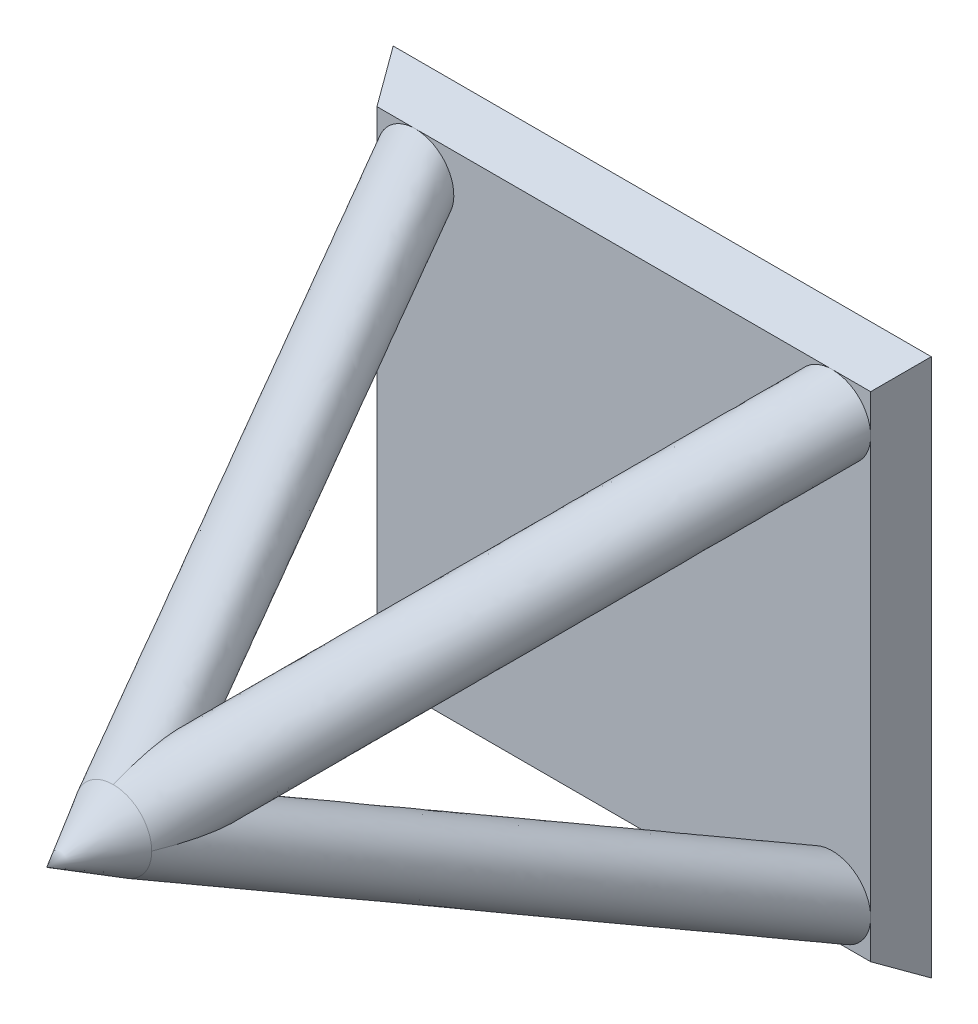
ISO-10303-21;
HEADER;
FILE_DESCRIPTION(('STEP AP214'),'2;1');
FILE_NAME('part.step','',(''),(''),'','','');
FILE_SCHEMA(('AUTOMOTIVE_DESIGN { 1 0 10303 214 1 1 1 1 }'));
ENDSEC;
DATA;
#1=APPLICATION_CONTEXT('core data for automotive mechanical design processes');
#2=APPLICATION_PROTOCOL_DEFINITION('international standard','automotive_design',2000,#1);
#3=PRODUCT_CONTEXT('',#1,'mechanical');
#4=PRODUCT('Part','Part','',(#3));
#5=PRODUCT_RELATED_PRODUCT_CATEGORY('part','',(#4));
#6=PRODUCT_DEFINITION_FORMATION('','',#4);
#7=PRODUCT_DEFINITION_CONTEXT('part definition',#1,'design');
#8=PRODUCT_DEFINITION('design','',#6,#7);
#9=PRODUCT_DEFINITION_SHAPE('','',#8);
#10=(LENGTH_UNIT() NAMED_UNIT(*) SI_UNIT(.MILLI.,.METRE.));
#11=(NAMED_UNIT(*) PLANE_ANGLE_UNIT() SI_UNIT($,.RADIAN.));
#12=(NAMED_UNIT(*) SI_UNIT($,.STERADIAN.) SOLID_ANGLE_UNIT());
#13=UNCERTAINTY_MEASURE_WITH_UNIT(LENGTH_MEASURE(1.E-05),#10,'distance_accuracy_value','');
#14=(GEOMETRIC_REPRESENTATION_CONTEXT(3) GLOBAL_UNCERTAINTY_ASSIGNED_CONTEXT((#13)) GLOBAL_UNIT_ASSIGNED_CONTEXT((#10,
#11,#12)) REPRESENTATION_CONTEXT('',''));
#15=CARTESIAN_POINT('',(0.,0.,0.));
#16=DIRECTION('',(0.,0.,1.));
#17=DIRECTION('',(1.,0.,0.));
#18=AXIS2_PLACEMENT_3D('',#15,#16,#17);
#19=CARTESIAN_POINT('',(0.,0.,1.));
#20=DIRECTION('',(0.,0.,1.));
#21=DIRECTION('',(1.,0.,0.));
#22=AXIS2_PLACEMENT_3D('',#19,#20,#21);
#23=PLANE('',#22);
#24=DIRECTION('',(-1.,0.,0.));
#25=VECTOR('',#24,1.);
#26=CARTESIAN_POINT('',(-7.,-6.42264973081037,1.));
#27=LINE('',#26,#25);
#28=CARTESIAN_POINT('',(-5.42264973081037,-6.42264973081037,1.));
#29=VERTEX_POINT('',#28);
#30=CARTESIAN_POINT('',(5.42264973081043,-6.42264973081037,1.));
#31=VERTEX_POINT('',#30);
#32=EDGE_CURVE('E254',#29,#31,#27,.F.);
#33=ORIENTED_EDGE('',*,*,#32,.T.);
#34=CARTESIAN_POINT('',(5.42264973081043,-5.42264973081032,1.));
#35=DIRECTION('',(0.,0.,1.));
#36=DIRECTION('',(0.,-1.,0.));
#37=AXIS2_PLACEMENT_3D('',#34,#35,#36);
#38=CIRCLE('',#37,1.);
#39=CARTESIAN_POINT('',(6.42264973081037,-5.42264973081032,1.));
#40=VERTEX_POINT('',#39);
#41=EDGE_CURVE('E52',#40,#31,#38,.T.);
#42=ORIENTED_EDGE('',*,*,#41,.F.);
#43=DIRECTION('',(0.,-1.,0.));
#44=VECTOR('',#43,1.);
#45=CARTESIAN_POINT('',(6.42264973081037,7.,1.));
#46=LINE('',#45,#44);
#47=CARTESIAN_POINT('',(6.42264973081037,5.42264973081037,1.));
#48=VERTEX_POINT('',#47);
#49=EDGE_CURVE('E259',#40,#48,#46,.F.);
#50=ORIENTED_EDGE('',*,*,#49,.T.);
#51=CARTESIAN_POINT('',(5.42264973081037,5.42264973081037,1.));
#52=DIRECTION('',(0.,0.,1.));
#53=DIRECTION('',(1.,0.,0.));
#54=AXIS2_PLACEMENT_3D('',#51,#52,#53);
#55=CIRCLE('',#54,1.);
#56=CARTESIAN_POINT('',(5.42264973081037,6.42264973081037,1.));
#57=VERTEX_POINT('',#56);
#58=EDGE_CURVE('E150',#57,#48,#55,.T.);
#59=ORIENTED_EDGE('',*,*,#58,.F.);
#60=DIRECTION('',(1.,0.,0.));
#61=VECTOR('',#60,1.);
#62=CARTESIAN_POINT('',(-7.,6.42264973081037,1.));
#63=LINE('',#62,#61);
#64=CARTESIAN_POINT('',(-5.42264973081039,6.42264973081037,1.));
#65=VERTEX_POINT('',#64);
#66=EDGE_CURVE('E260',#57,#65,#63,.F.);
#67=ORIENTED_EDGE('',*,*,#66,.T.);
#68=CARTESIAN_POINT('',(-5.42264973081039,5.42264973081035,1.));
#69=DIRECTION('',(0.,0.,1.));
#70=DIRECTION('',(0.,1.,0.));
#71=AXIS2_PLACEMENT_3D('',#68,#69,#70);
#72=CIRCLE('',#71,1.);
#73=CARTESIAN_POINT('',(-6.42264973081039,5.42264973081035,1.));
#74=VERTEX_POINT('',#73);
#75=EDGE_CURVE('E172',#74,#65,#72,.T.);
#76=ORIENTED_EDGE('',*,*,#75,.F.);
#77=DIRECTION('',(0.,1.,0.));
#78=VECTOR('',#77,1.);
#79=CARTESIAN_POINT('',(-6.42264973081037,7.,1.));
#80=LINE('',#79,#78);
#81=CARTESIAN_POINT('',(-6.42264973081037,-5.42264973081037,1.));
#82=VERTEX_POINT('',#81);
#83=EDGE_CURVE('E250',#74,#82,#80,.F.);
#84=ORIENTED_EDGE('',*,*,#83,.T.);
#85=CARTESIAN_POINT('',(-5.42264973081037,-5.42264973081037,1.));
#86=DIRECTION('',(0.,0.,1.));
#87=DIRECTION('',(-1.,0.,0.));
#88=AXIS2_PLACEMENT_3D('',#85,#86,#87);
#89=CIRCLE('',#88,1.);
#90=EDGE_CURVE('E59',#29,#82,#89,.T.);
#91=ORIENTED_EDGE('',*,*,#90,.F.);
#92=EDGE_LOOP('',(#33,#42,#50,#59,#67,#76,#84,#91));
#93=FACE_BOUND('',#92,.T.);
#94=ADVANCED_FACE('F33',(#93),#23,.T.);
#95=CARTESIAN_POINT('',(6.42264973081037,-6.42264973081037,1.));
#96=VERTEX_POINT('',#95);
#97=EDGE_CURVE('E255',#96,#40,#46,.F.);
#98=ORIENTED_EDGE('',*,*,#97,.T.);
#99=EDGE_CURVE('E179',#31,#40,#38,.T.);
#100=ORIENTED_EDGE('',*,*,#99,.F.);
#101=EDGE_CURVE('E249',#31,#96,#27,.F.);
#102=ORIENTED_EDGE('',*,*,#101,.T.);
#103=EDGE_LOOP('',(#98,#100,#102));
#104=FACE_BOUND('',#103,.T.);
#105=ADVANCED_FACE('F194',(#104),#23,.T.);
#106=CARTESIAN_POINT('',(0.,0.,14.2827248943264));
#107=DIRECTION('',(0.,0.,1.));
#108=DIRECTION('',(1.,0.,0.));
#109=AXIS2_PLACEMENT_3D('',#106,#107,#108);
#110=CIRCLE('',#109,1.);
#111=DIRECTION('',(0.353553390593266,0.353553390593266,-0.866025403784445));
#112=VECTOR('',#111,1.);
#113=SURFACE_OF_LINEAR_EXTRUSION('',#110,#112);
#114=EDGE_CURVE('E134',#48,#57,#55,.T.);
#115=ORIENTED_EDGE('',*,*,#114,.T.);
#116=ORIENTED_EDGE('',*,*,#58,.T.);
#117=EDGE_LOOP('',(#115,#116));
#118=FACE_BOUND('',#117,.T.);
#119=CARTESIAN_POINT('',(1.00000000000006,0.,14.2827248943262));
#120=CARTESIAN_POINT('',(1.00095247158773,0.,14.2803918097725));
#121=CARTESIAN_POINT('',(1.00190378573239,0.,14.2780582428588));
#122=CARTESIAN_POINT('',(1.04999941742813,-3.15060816440007E-12,14.159911554569));
#123=CARTESIAN_POINT('',(1.09428856773639,-3.88029549310956E-13,14.0429127130079));
#124=CARTESIAN_POINT('',(1.17649504622401,3.43390337549671E-13,13.8066698322435));
#125=CARTESIAN_POINT('',(1.21441185282404,-1.68816058794624E-12,13.6874256101422));
#126=CARTESIAN_POINT('',(1.26558620893331,-1.09452970989525E-12,13.5069173676038));
#127=CARTESIAN_POINT('',(1.28169773790506,-2.89122395048951E-13,13.4464578811851));
#128=CARTESIAN_POINT('',(1.31176474988059,3.00190177300115E-13,13.3250253952196));
#129=CARTESIAN_POINT('',(1.32572107611012,0.,13.2640526063995));
#130=CARTESIAN_POINT('',(1.35116004297669,0.,13.1415880318274));
#131=CARTESIAN_POINT('',(1.36264262043789,0.,13.0800962328623));
#132=CARTESIAN_POINT('',(1.38268857034576,0.,12.9565309102517));
#133=CARTESIAN_POINT('',(1.39124753220577,0.,12.8944566515766));
#134=CARTESIAN_POINT('',(1.40242129150147,0.,12.791194865343));
#135=CARTESIAN_POINT('',(1.40606787990283,0.,12.7501191725009));
#136=CARTESIAN_POINT('',(1.4114961727792,0.,12.6678472164657));
#137=CARTESIAN_POINT('',(1.41327825698485,0.,12.6266509795375));
#138=CARTESIAN_POINT('',(1.41458844448939,0.,12.544339253495));
#139=CARTESIAN_POINT('',(1.41412328319511,0.,12.5032238921256));
#140=CARTESIAN_POINT('',(1.41040552395881,0.,12.4210869293176));
#141=CARTESIAN_POINT('',(1.40715202075742,-1.04465119765171E-13,12.3800653626676));
#142=CARTESIAN_POINT('',(1.39794666536119,0.,12.3057766834646));
#143=CARTESIAN_POINT('',(1.39258385936221,0.,12.2724391260823));
#144=CARTESIAN_POINT('',(1.37877126368471,0.,12.2064304979355));
#145=CARTESIAN_POINT('',(1.37032603890566,0.,12.1737585166459));
#146=CARTESIAN_POINT('',(1.34926204043655,0.,12.1091744881437));
#147=CARTESIAN_POINT('',(1.33657992124411,0.,12.0772823806614));
#148=CARTESIAN_POINT('',(1.30576699966473,0.,12.0162463680328));
#149=CARTESIAN_POINT('',(1.28766439090466,0.,11.9870892437889));
#150=CARTESIAN_POINT('',(1.25433441731583,0.,11.945834876596));
#151=CARTESIAN_POINT('',(1.24138920273573,0.,11.9319043394484));
#152=CARTESIAN_POINT('',(1.21341853384276,0.,11.9063119275512));
#153=CARTESIAN_POINT('',(1.19839557822594,0.,11.8946473676539));
#154=CARTESIAN_POINT('',(1.16640868690299,0.,11.8741123585718));
#155=CARTESIAN_POINT('',(1.14943383321417,0.,11.8652587826481));
#156=CARTESIAN_POINT('',(1.11415155732731,0.,11.8507938938697));
#157=CARTESIAN_POINT('',(1.09584357911664,0.,11.8451839426713));
#158=CARTESIAN_POINT('',(1.05978775727,0.,11.8374268803725));
#159=CARTESIAN_POINT('',(1.04208212265294,0.,11.8350765001178));
#160=CARTESIAN_POINT('',(1.0065001489417,0.,11.8328755877828));
#161=CARTESIAN_POINT('',(0.988623542579538,0.,11.8330299819223));
#162=CARTESIAN_POINT('',(0.94017953149927,0.,11.836346501992));
#163=CARTESIAN_POINT('',(0.909759839811488,0.,11.8415979600568));
#164=CARTESIAN_POINT('',(0.850061560937177,0.,11.8565935212211));
#165=CARTESIAN_POINT('',(0.820786588103361,0.,11.8663507757101));
#166=CARTESIAN_POINT('',(0.764354622377072,0.,11.8887347699382));
#167=CARTESIAN_POINT('',(0.737160978345244,0.,11.901271285511));
#168=CARTESIAN_POINT('',(0.683978475773765,0.,11.9285586032647));
#169=CARTESIAN_POINT('',(0.657988004110974,0.,11.9433063212633));
#170=CARTESIAN_POINT('',(0.58145942147972,0.,11.9901498417349));
#171=CARTESIAN_POINT('',(0.532487379156112,0.,12.024791377357));
#172=CARTESIAN_POINT('',(0.429915774485225,0.,12.1045419348552));
#173=CARTESIAN_POINT('',(0.376940475904005,0.,12.1504297593496));
#174=CARTESIAN_POINT('',(0.274609364980922,0.,12.2460995276116));
#175=CARTESIAN_POINT('',(0.225256188127097,0.,12.2958842534236));
#176=CARTESIAN_POINT('',(0.129735733450403,0.,12.3980816477076));
#177=CARTESIAN_POINT('',(0.0835582338668074,0.,12.4504848470378));
#178=CARTESIAN_POINT('',(-0.00623025447493529,0.,12.5574511479309));
#179=CARTESIAN_POINT('',(-0.0498406569391731,0.,12.6120147381782));
#180=CARTESIAN_POINT('',(-0.177204799032464,0.,12.7781852260808));
#181=CARTESIAN_POINT('',(-0.257589167056134,0.,12.8923798964255));
#182=CARTESIAN_POINT('',(-0.410772800367922,0.,13.1256453919952));
#183=CARTESIAN_POINT('',(-0.483573814141634,-1.8566006021488E-13,13.2447150843324));
#184=CARTESIAN_POINT('',(-0.622280430420259,-5.1244225089425E-13,13.4867655718524));
#185=CARTESIAN_POINT('',(-0.688186685010203,-7.03935146997921E-13,13.6097459957332));
#186=CARTESIAN_POINT('',(-0.839750536160516,9.92717383731319E-13,13.911630843641));
#187=CARTESIAN_POINT('',(-0.922026837057796,3.79129073221929E-12,14.0922616779955));
#188=CARTESIAN_POINT('',(-0.998093865758277,0.,14.2780592080127));
#189=CARTESIAN_POINT('',(-0.999047512172989,0.,14.2803918227562));
#190=CARTESIAN_POINT('',(-1.,0.,14.2827248943264));
#191=B_SPLINE_CURVE_WITH_KNOTS('',3,(#119,#120,#121,#122,#123,#124,#125,#126,#127,#128,#129,
#130,#131,#132,#133,#134,#135,#136,#137,#138,#139,#140,#141,#142,#143,#144,#145,#146,#147,#148,
#149,#150,#151,#152,#153,#154,#155,#156,#157,#158,#159,#160,#161,#162,#163,#164,#165,#166,#167,
#168,#169,#170,#171,#172,#173,#174,#175,#176,#177,#178,#179,#180,#181,#182,#183,#184,#185,#186,
#187,#188,#189,#190),.UNSPECIFIED.,.F.,.F.,(4,2,2,2,2,2,2,2,2,2,2,2,2,2,2,2,2,2,2,2,2,2,2,2,2,2,
2,2,2,2,2,2,2,2,2,4),(0.,0.00756007770868939,0.382681877783375,0.757834366817101,
0.945511216454522,1.13311445023064,1.32072247454461,1.50861228839686,1.63229047661093,
1.75594347124023,1.87922608549966,2.00254873969712,2.10373931980384,2.20478064605285,
2.30740579928977,2.40950617558983,2.46635077405585,2.52312759607237,2.58023905205231,
2.6373744657412,2.69075658879766,2.74424371288378,2.83631460270398,2.92865594166437,
3.01835158168252,3.10792325856378,3.2874672894518,3.49746875143256,3.70762152785638,
3.91706271661904,4.12655155509135,4.54509366840899,4.9635390643266,5.38194484912462,
5.97667867126261,5.98423874896989),.UNSPECIFIED.);
#192=CARTESIAN_POINT('',(0.,0.,12.5506740867574));
#193=VERTEX_POINT('',#192);
#194=CARTESIAN_POINT('',(1.,0.,14.2827248943264));
#195=VERTEX_POINT('',#194);
#196=EDGE_CURVE('E146',#193,#195,#191,.F.);
#197=ORIENTED_EDGE('',*,*,#196,.F.);
#198=CARTESIAN_POINT('',(0.,0.999999999999999,14.2827248943264));
#199=CARTESIAN_POINT('',(0.,1.00095247158767,14.2803918097726));
#200=CARTESIAN_POINT('',(0.,1.00190378573233,14.2780582428589));
#201=CARTESIAN_POINT('',(1.92073782697346E-12,1.04999941742809,14.1599115545691));
#202=CARTESIAN_POINT('',(0.,1.09428856773634,14.042912713008));
#203=CARTESIAN_POINT('',(0.,1.17649504622396,13.8066698322436));
#204=CARTESIAN_POINT('',(1.75042928150668E-12,1.21441185282399,13.6874256101423));
#205=CARTESIAN_POINT('',(1.06882775437573E-12,1.26558620893327,13.5069173676039));
#206=CARTESIAN_POINT('',(2.85984764109471E-13,1.28169773790502,13.4464578811853));
#207=CARTESIAN_POINT('',(-2.87272866186111E-13,1.31176474988055,13.3250253952198));
#208=CARTESIAN_POINT('',(0.,1.32572107611008,13.2640526063996));
#209=CARTESIAN_POINT('',(0.,1.35116004297665,13.1415880318275));
#210=CARTESIAN_POINT('',(0.,1.36264262043786,13.0800962328624));
#211=CARTESIAN_POINT('',(0.,1.38268857034574,12.9565309102518));
#212=CARTESIAN_POINT('',(0.,1.39124753220574,12.8944566515767));
#213=CARTESIAN_POINT('',(0.,1.40242129150145,12.7911948653431));
#214=CARTESIAN_POINT('',(0.,1.40606787990281,12.750119172501));
#215=CARTESIAN_POINT('',(0.,1.41149617277919,12.6678472164658));
#216=CARTESIAN_POINT('',(0.,1.41327825698484,12.6266509795376));
#217=CARTESIAN_POINT('',(0.,1.41458844448938,12.5443392534951));
#218=CARTESIAN_POINT('',(0.,1.4141232831951,12.5032238921256));
#219=CARTESIAN_POINT('',(0.,1.4104055239588,12.4210869293176));
#220=CARTESIAN_POINT('',(1.0948436965104E-13,1.40715202075741,12.3800653626676));
#221=CARTESIAN_POINT('',(0.,1.39794666536118,12.3057766834646));
#222=CARTESIAN_POINT('',(0.,1.3925838593622,12.2724391260823));
#223=CARTESIAN_POINT('',(0.,1.37877126368471,12.2064304979355));
#224=CARTESIAN_POINT('',(0.,1.37032603890565,12.1737585166459));
#225=CARTESIAN_POINT('',(0.,1.34926204043655,12.1091744881437));
#226=CARTESIAN_POINT('',(0.,1.33657992124412,12.0772823806615));
#227=CARTESIAN_POINT('',(0.,1.30576699966476,12.0162463680329));
#228=CARTESIAN_POINT('',(0.,1.28766439090471,11.987089243789));
#229=CARTESIAN_POINT('',(0.,1.2543344173159,11.9458348765961));
#230=CARTESIAN_POINT('',(0.,1.2413892027358,11.9319043394485));
#231=CARTESIAN_POINT('',(0.,1.21341853384283,11.9063119275513));
#232=CARTESIAN_POINT('',(0.,1.19839557822602,11.894647367654));
#233=CARTESIAN_POINT('',(0.,1.16640868690307,11.8741123585719));
#234=CARTESIAN_POINT('',(0.,1.14943383321425,11.8652587826481));
#235=CARTESIAN_POINT('',(0.,1.11415155732739,11.8507938938697));
#236=CARTESIAN_POINT('',(0.,1.09584357911671,11.8451839426713));
#237=CARTESIAN_POINT('',(0.,1.05978775727008,11.8374268803726));
#238=CARTESIAN_POINT('',(0.,1.04208212265302,11.8350765001178));
#239=CARTESIAN_POINT('',(0.,1.00650014894178,11.8328755877828));
#240=CARTESIAN_POINT('',(0.,0.988623542579618,11.8330299819223));
#241=CARTESIAN_POINT('',(0.,0.94017953149936,11.836346501992));
#242=CARTESIAN_POINT('',(0.,0.909759839811587,11.8415979600568));
#243=CARTESIAN_POINT('',(0.,0.850061560937294,11.8565935212211));
#244=CARTESIAN_POINT('',(0.,0.820786588103487,11.86635077571));
#245=CARTESIAN_POINT('',(0.,0.764354622377217,11.8887347699382));
#246=CARTESIAN_POINT('',(0.,0.737160978345401,11.901271285511));
#247=CARTESIAN_POINT('',(0.,0.683978475773943,11.9285586032646));
#248=CARTESIAN_POINT('',(0.,0.657988004111163,11.9433063212632));
#249=CARTESIAN_POINT('',(0.,0.581459421479941,11.9901498417348));
#250=CARTESIAN_POINT('',(0.,0.532487379156352,12.0247913773568));
#251=CARTESIAN_POINT('',(0.,0.429915774485507,12.1045419348549));
#252=CARTESIAN_POINT('',(0.,0.376940475904309,12.1504297593493));
#253=CARTESIAN_POINT('',(0.,0.27460936498127,12.2460995276112));
#254=CARTESIAN_POINT('',(0.,0.225256188127465,12.2958842534233));
#255=CARTESIAN_POINT('',(0.,0.12973573345081,12.3980816477072));
#256=CARTESIAN_POINT('',(0.,0.0835582338672327,12.4504848470373));
#257=CARTESIAN_POINT('',(0.,-0.00623025447447493,12.5574511479304));
#258=CARTESIAN_POINT('',(0.,-0.0498406569386963,12.6120147381776));
#259=CARTESIAN_POINT('',(0.,-0.17720479903194,12.7781852260801));
#260=CARTESIAN_POINT('',(0.,-0.257589167055582,12.8923798964247));
#261=CARTESIAN_POINT('',(0.,-0.410772800367319,13.1256453919943));
#262=CARTESIAN_POINT('',(1.88431549467464E-13,-0.483573814141009,13.2447150843314));
#263=CARTESIAN_POINT('',(5.06635401601743E-13,-0.622280430419596,13.4867655718512));
#264=CARTESIAN_POINT('',(6.85690644792282E-13,-0.688186685009523,13.6097459957319));
#265=CARTESIAN_POINT('',(-9.74331920767588E-13,-0.839750536160093,13.91163084364));
#266=CARTESIAN_POINT('',(-3.69570863990759E-12,-0.922026837057612,14.092261677995));
#267=CARTESIAN_POINT('',(0.,-0.998093865758278,14.2780592080127));
#268=CARTESIAN_POINT('',(0.,-0.99904751217299,14.2803918227562));
#269=CARTESIAN_POINT('',(0.,-1.,14.2827248943264));
#270=B_SPLINE_CURVE_WITH_KNOTS('',3,(#198,#199,#200,#201,#202,#203,#204,#205,#206,#207,#208,
#209,#210,#211,#212,#213,#214,#215,#216,#217,#218,#219,#220,#221,#222,#223,#224,#225,#226,#227,
#228,#229,#230,#231,#232,#233,#234,#235,#236,#237,#238,#239,#240,#241,#242,#243,#244,#245,#246,
#247,#248,#249,#250,#251,#252,#253,#254,#255,#256,#257,#258,#259,#260,#261,#262,#263,#264,#265,
#266,#267,#268,#269),.UNSPECIFIED.,.F.,.F.,(4,2,2,2,2,2,2,2,2,2,2,2,2,2,2,2,2,2,2,2,2,2,2,2,2,2,
2,2,2,2,2,2,2,2,2,4),(0.,0.00756007770868964,0.382681877783374,0.757834366817101,
0.945511216454521,1.13311445023064,1.32072247454461,1.50861228839687,1.63229047661096,
1.7559434712403,1.87922608549977,2.00254873969727,2.10373931980396,2.20478064605293,
2.30740579928982,2.40950617558984,2.46635077405587,2.52312759607239,2.58023905205234,
2.63737446574124,2.6907565887977,2.74424371288381,2.83631460270398,2.92865594166434,
3.01835158168244,3.10792325856365,3.28746728945159,3.49746875143223,3.70762152785592,
3.91706271661846,4.12655155509065,4.54509366840804,4.96353906432541,5.38194484912318,
5.97667867126273,5.98423874897),.UNSPECIFIED.);
#271=CARTESIAN_POINT('',(0.,1.,14.2827248943264));
#272=VERTEX_POINT('',#271);
#273=EDGE_CURVE('E141',#272,#193,#270,.T.);
#274=ORIENTED_EDGE('',*,*,#273,.F.);
#275=EDGE_CURVE('E124',#195,#272,#110,.T.);
#276=ORIENTED_EDGE('',*,*,#275,.F.);
#277=EDGE_LOOP('',(#197,#274,#276));
#278=FACE_BOUND('',#277,.T.);
#279=ADVANCED_FACE('F145',(#118,#278),#113,.F.);
#280=CARTESIAN_POINT('',(0.,0.,14.2827248943264));
#281=DIRECTION('',(0.,0.,1.));
#282=DIRECTION('',(-1.,0.,0.));
#283=AXIS2_PLACEMENT_3D('',#280,#281,#282);
#284=CIRCLE('',#283,1.);
#285=DIRECTION('',(-0.353553390593266,-0.353553390593266,-0.866025403784445));
#286=VECTOR('',#285,1.);
#287=SURFACE_OF_LINEAR_EXTRUSION('',#284,#286);
#288=EDGE_CURVE('E171',#82,#29,#89,.T.);
#289=ORIENTED_EDGE('',*,*,#288,.T.);
#290=ORIENTED_EDGE('',*,*,#90,.T.);
#291=EDGE_LOOP('',(#289,#290));
#292=FACE_BOUND('',#291,.T.);
#293=CARTESIAN_POINT('',(0.,-0.999999999999999,14.2827248943264));
#294=CARTESIAN_POINT('',(0.,-1.00095247158767,14.2803918097726));
#295=CARTESIAN_POINT('',(0.,-1.00190378573233,14.2780582428589));
#296=CARTESIAN_POINT('',(-1.915912437761E-12,-1.04999941742808,14.1599115545691));
#297=CARTESIAN_POINT('',(0.,-1.09428856773633,14.042912713008));
#298=CARTESIAN_POINT('',(0.,-1.17649504622397,13.8066698322436));
#299=CARTESIAN_POINT('',(-1.74873814425717E-12,-1.21441185282399,13.6874256101423));
#300=CARTESIAN_POINT('',(-1.06528197268629E-12,-1.26558620893327,13.5069173676039));
#301=CARTESIAN_POINT('',(-2.81228296126655E-13,-1.28169773790502,13.4464578811853));
#302=CARTESIAN_POINT('',(2.92407573775463E-13,-1.31176474988055,13.3250253952198));
#303=CARTESIAN_POINT('',(0.,-1.32572107611008,13.2640526063996));
#304=CARTESIAN_POINT('',(0.,-1.35116004297665,13.1415880318275));
#305=CARTESIAN_POINT('',(0.,-1.36264262043786,13.0800962328624));
#306=CARTESIAN_POINT('',(0.,-1.38268857034573,12.9565309102518));
#307=CARTESIAN_POINT('',(0.,-1.39124753220574,12.8944566515767));
#308=CARTESIAN_POINT('',(0.,-1.40242129150144,12.7911948653431));
#309=CARTESIAN_POINT('',(0.,-1.40606787990281,12.750119172501));
#310=CARTESIAN_POINT('',(0.,-1.41149617277919,12.6678472164658));
#311=CARTESIAN_POINT('',(0.,-1.41327825698483,12.6266509795376));
#312=CARTESIAN_POINT('',(0.,-1.41458844448938,12.5443392534951));
#313=CARTESIAN_POINT('',(0.,-1.41412328319509,12.5032238921256));
#314=CARTESIAN_POINT('',(0.,-1.41040552395879,12.4210869293176));
#315=CARTESIAN_POINT('',(-1.0442317432693E-13,-1.4071520207574,12.3800653626676));
#316=CARTESIAN_POINT('',(0.,-1.39794666536117,12.3057766834646));
#317=CARTESIAN_POINT('',(0.,-1.39258385936219,12.2724391260823));
#318=CARTESIAN_POINT('',(0.,-1.3787712636847,12.2064304979355));
#319=CARTESIAN_POINT('',(0.,-1.37032603890565,12.1737585166459));
#320=CARTESIAN_POINT('',(0.,-1.34926204043655,12.1091744881437));
#321=CARTESIAN_POINT('',(0.,-1.33657992124412,12.0772823806615));
#322=CARTESIAN_POINT('',(0.,-1.30576699966476,12.0162463680329));
#323=CARTESIAN_POINT('',(0.,-1.2876643909047,11.987089243789));
#324=CARTESIAN_POINT('',(0.,-1.25433441731589,11.9458348765961));
#325=CARTESIAN_POINT('',(0.,-1.24138920273579,11.9319043394485));
#326=CARTESIAN_POINT('',(0.,-1.21341853384282,11.9063119275513));
#327=CARTESIAN_POINT('',(0.,-1.19839557822601,11.894647367654));
#328=CARTESIAN_POINT('',(0.,-1.16640868690306,11.8741123585719));
#329=CARTESIAN_POINT('',(0.,-1.14943383321424,11.8652587826481));
#330=CARTESIAN_POINT('',(0.,-1.11415155732738,11.8507938938697));
#331=CARTESIAN_POINT('',(0.,-1.0958435791167,11.8451839426713));
#332=CARTESIAN_POINT('',(0.,-1.05978775727007,11.8374268803726));
#333=CARTESIAN_POINT('',(0.,-1.04208212265301,11.8350765001178));
#334=CARTESIAN_POINT('',(0.,-1.00650014894177,11.8328755877828));
#335=CARTESIAN_POINT('',(0.,-0.988623542579607,11.8330299819223));
#336=CARTESIAN_POINT('',(0.,-0.94017953149935,11.836346501992));
#337=CARTESIAN_POINT('',(0.,-0.909759839811577,11.8415979600568));
#338=CARTESIAN_POINT('',(0.,-0.850061560937284,11.8565935212211));
#339=CARTESIAN_POINT('',(0.,-0.820786588103476,11.86635077571));
#340=CARTESIAN_POINT('',(0.,-0.764354622377207,11.8887347699382));
#341=CARTESIAN_POINT('',(0.,-0.73716097834539,11.901271285511));
#342=CARTESIAN_POINT('',(0.,-0.683978475773933,11.9285586032646));
#343=CARTESIAN_POINT('',(0.,-0.657988004111152,11.9433063212632));
#344=CARTESIAN_POINT('',(0.,-0.581459421479929,11.9901498417348));
#345=CARTESIAN_POINT('',(0.,-0.53248737915634,12.0247913773568));
#346=CARTESIAN_POINT('',(0.,-0.429915774485494,12.1045419348549));
#347=CARTESIAN_POINT('',(0.,-0.376940475904295,12.1504297593493));
#348=CARTESIAN_POINT('',(0.,-0.274609364981255,12.2460995276112));
#349=CARTESIAN_POINT('',(0.,-0.225256188127449,12.2958842534233));
#350=CARTESIAN_POINT('',(0.,-0.129735733450793,12.3980816477072));
#351=CARTESIAN_POINT('',(0.,-0.0835582338672151,12.4504848470373));
#352=CARTESIAN_POINT('',(0.,0.00623025447449338,12.5574511479304));
#353=CARTESIAN_POINT('',(0.,0.0498406569387149,12.6120147381776));
#354=CARTESIAN_POINT('',(0.,0.17720479903196,12.7781852260801));
#355=CARTESIAN_POINT('',(0.,0.257589167055603,12.8923798964248));
#356=CARTESIAN_POINT('',(0.,0.41077280036734,13.1256453919943));
#357=CARTESIAN_POINT('',(0.,0.483573814141029,13.2447150843314));
#358=CARTESIAN_POINT('',(-6.15956781130463E-13,0.622280430419619,13.4867655718512));
#359=CARTESIAN_POINT('',(-1.09416021774482E-12,0.688186685009551,13.6097459957319));
#360=CARTESIAN_POINT('',(1.54627858141879E-12,0.839750536160098,13.9116308436401));
#361=CARTESIAN_POINT('',(6.26566315913727E-12,0.922026837057578,14.0922616779951));
#362=CARTESIAN_POINT('',(1.53803518638897E-13,0.998093865758278,14.2780592080127));
#363=CARTESIAN_POINT('',(0.,0.999047512172991,14.2803918227562));
#364=CARTESIAN_POINT('',(0.,1.,14.2827248943264));
#365=B_SPLINE_CURVE_WITH_KNOTS('',3,(#293,#294,#295,#296,#297,#298,#299,#300,#301,#302,#303,
#304,#305,#306,#307,#308,#309,#310,#311,#312,#313,#314,#315,#316,#317,#318,#319,#320,#321,#322,
#323,#324,#325,#326,#327,#328,#329,#330,#331,#332,#333,#334,#335,#336,#337,#338,#339,#340,#341,
#342,#343,#344,#345,#346,#347,#348,#349,#350,#351,#352,#353,#354,#355,#356,#357,#358,#359,#360,
#361,#362,#363,#364),.UNSPECIFIED.,.F.,.F.,(4,2,2,2,2,2,2,2,2,2,2,2,2,2,2,2,2,2,2,2,2,2,2,2,2,2,
2,2,2,2,2,2,2,2,2,4),(0.,0.00756007770868948,0.382681877783375,0.757834366817102,
0.945511216454522,1.13311445023064,1.32072247454461,1.50861228839687,1.63229047661096,
1.7559434712403,1.87922608549977,2.00254873969727,2.10373931980396,2.20478064605293,
2.30740579928981,2.40950617558984,2.46635077405586,2.52312759607239,2.58023905205234,
2.63737446574123,2.69075658879769,2.74424371288381,2.83631460270398,2.92865594166434,
3.01835158168244,3.10792325856365,3.28746728945159,3.49746875143223,3.70762152785593,
3.91706271661847,4.12655155509066,4.54509366840807,4.96353906432544,5.38194484912322,
5.97667867126271,5.98423874896999),.UNSPECIFIED.);
#366=CARTESIAN_POINT('',(0.,-1.,14.2827248943264));
#367=VERTEX_POINT('',#366);
#368=EDGE_CURVE('E11',#367,#193,#365,.T.);
#369=ORIENTED_EDGE('',*,*,#368,.F.);
#370=CARTESIAN_POINT('',(-1.,0.,14.2827248943264));
#371=VERTEX_POINT('',#370);
#372=EDGE_CURVE('E136',#371,#367,#110,.T.);
#373=ORIENTED_EDGE('',*,*,#372,.F.);
#374=CARTESIAN_POINT('',(-1.,0.,14.2827248943264));
#375=CARTESIAN_POINT('',(-1.00095247158767,0.,14.2803918097726));
#376=CARTESIAN_POINT('',(-1.00190378573233,0.,14.2780582428589));
#377=CARTESIAN_POINT('',(-1.04999941742808,1.92550861060393E-12,14.1599115545691));
#378=CARTESIAN_POINT('',(-1.09428856773633,0.,14.042912713008));
#379=CARTESIAN_POINT('',(-1.17649504622397,0.,13.8066698322436));
#380=CARTESIAN_POINT('',(-1.21441185282399,1.75070817216089E-12,13.6874256101423));
#381=CARTESIAN_POINT('',(-1.26558620893328,1.06893222335976E-12,13.5069173676039));
#382=CARTESIAN_POINT('',(-1.28169773790502,2.85800339984057E-13,13.4464578811853));
#383=CARTESIAN_POINT('',(-1.31176474988056,-2.8703431492396E-13,13.3250253952198));
#384=CARTESIAN_POINT('',(-1.32572107611008,0.,13.2640526063996));
#385=CARTESIAN_POINT('',(-1.35116004297666,0.,13.1415880318275));
#386=CARTESIAN_POINT('',(-1.36264262043786,0.,13.0800962328624));
#387=CARTESIAN_POINT('',(-1.38268857034574,0.,12.9565309102518));
#388=CARTESIAN_POINT('',(-1.39124753220575,0.,12.8944566515767));
#389=CARTESIAN_POINT('',(-1.40242129150145,0.,12.7911948653431));
#390=CARTESIAN_POINT('',(-1.40606787990282,0.,12.750119172501));
#391=CARTESIAN_POINT('',(-1.4114961727792,0.,12.6678472164658));
#392=CARTESIAN_POINT('',(-1.41327825698484,0.,12.6266509795376));
#393=CARTESIAN_POINT('',(-1.41458844448939,0.,12.5443392534951));
#394=CARTESIAN_POINT('',(-1.4141232831951,0.,12.5032238921256));
#395=CARTESIAN_POINT('',(-1.4104055239588,0.,12.4210869293176));
#396=CARTESIAN_POINT('',(-1.40715202075741,1.09426494236428E-13,12.3800653626676));
#397=CARTESIAN_POINT('',(-1.39794666536118,0.,12.3057766834646));
#398=CARTESIAN_POINT('',(-1.3925838593622,0.,12.2724391260823));
#399=CARTESIAN_POINT('',(-1.37877126368471,0.,12.2064304979355));
#400=CARTESIAN_POINT('',(-1.37032603890566,0.,12.1737585166459));
#401=CARTESIAN_POINT('',(-1.34926204043656,0.,12.1091744881437));
#402=CARTESIAN_POINT('',(-1.33657992124413,0.,12.0772823806615));
#403=CARTESIAN_POINT('',(-1.30576699966477,0.,12.0162463680329));
#404=CARTESIAN_POINT('',(-1.28766439090472,0.,11.987089243789));
#405=CARTESIAN_POINT('',(-1.25433441731591,0.,11.9458348765961));
#406=CARTESIAN_POINT('',(-1.24138920273581,0.,11.9319043394485));
#407=CARTESIAN_POINT('',(-1.21341853384285,0.,11.9063119275513));
#408=CARTESIAN_POINT('',(-1.19839557822603,0.,11.894647367654));
#409=CARTESIAN_POINT('',(-1.16640868690308,0.,11.8741123585719));
#410=CARTESIAN_POINT('',(-1.14943383321427,0.,11.8652587826481));
#411=CARTESIAN_POINT('',(-1.11415155732741,0.,11.8507938938697));
#412=CARTESIAN_POINT('',(-1.09584357911673,0.,11.8451839426713));
#413=CARTESIAN_POINT('',(-1.0597877572701,0.,11.8374268803726));
#414=CARTESIAN_POINT('',(-1.04208212265304,0.,11.8350765001178));
#415=CARTESIAN_POINT('',(-1.0065001489418,0.,11.8328755877828));
#416=CARTESIAN_POINT('',(-0.988623542579635,0.,11.8330299819223));
#417=CARTESIAN_POINT('',(-0.940179531499379,0.,11.8363465019919));
#418=CARTESIAN_POINT('',(-0.909759839811608,0.,11.8415979600568));
#419=CARTESIAN_POINT('',(-0.850061560937317,0.,11.8565935212211));
#420=CARTESIAN_POINT('',(-0.82078658810351,0.,11.86635077571));
#421=CARTESIAN_POINT('',(-0.764354622377244,0.,11.8887347699381));
#422=CARTESIAN_POINT('',(-0.737160978345429,0.,11.9012712855109));
#423=CARTESIAN_POINT('',(-0.683978475773975,0.,11.9285586032646));
#424=CARTESIAN_POINT('',(-0.657988004111196,0.,11.9433063212632));
#425=CARTESIAN_POINT('',(-0.581459421479977,0.,11.9901498417348));
#426=CARTESIAN_POINT('',(-0.532487379156391,0.,12.0247913773568));
#427=CARTESIAN_POINT('',(-0.429915774485551,0.,12.1045419348549));
#428=CARTESIAN_POINT('',(-0.376940475904356,0.,12.1504297593493));
#429=CARTESIAN_POINT('',(-0.274609364981323,0.,12.2460995276112));
#430=CARTESIAN_POINT('',(-0.22525618812752,0.,12.2958842534232));
#431=CARTESIAN_POINT('',(-0.129735733450869,0.,12.3980816477071));
#432=CARTESIAN_POINT('',(-0.0835582338672933,0.,12.4504848470372));
#433=CARTESIAN_POINT('',(0.00623025447441086,0.,12.5574511479303));
#434=CARTESIAN_POINT('',(0.0498406569386304,0.,12.6120147381775));
#435=CARTESIAN_POINT('',(0.177204799031869,0.,12.77818522608));
#436=CARTESIAN_POINT('',(0.257589167055508,0.,12.8923798964246));
#437=CARTESIAN_POINT('',(0.410772800367239,0.,13.1256453919941));
#438=CARTESIAN_POINT('',(0.483573814140926,2.53988898251207E-13,13.2447150843312));
#439=CARTESIAN_POINT('',(0.62228043041951,4.41626334073491E-13,13.486765571851));
#440=CARTESIAN_POINT('',(0.688186685009438,4.42861328496882E-13,13.6097459957317));
#441=CARTESIAN_POINT('',(0.839750536160034,-6.30545751100251E-13,13.9116308436399));
#442=CARTESIAN_POINT('',(0.922026837057567,-2.1588122031001E-12,14.092261677995));
#443=CARTESIAN_POINT('',(0.998093865758279,0.,14.2780592080127));
#444=CARTESIAN_POINT('',(0.999047512172991,0.,14.2803918227562));
#445=CARTESIAN_POINT('',(1.,0.,14.2827248943264));
#446=B_SPLINE_CURVE_WITH_KNOTS('',3,(#374,#375,#376,#377,#378,#379,#380,#381,#382,#383,#384,
#385,#386,#387,#388,#389,#390,#391,#392,#393,#394,#395,#396,#397,#398,#399,#400,#401,#402,#403,
#404,#405,#406,#407,#408,#409,#410,#411,#412,#413,#414,#415,#416,#417,#418,#419,#420,#421,#422,
#423,#424,#425,#426,#427,#428,#429,#430,#431,#432,#433,#434,#435,#436,#437,#438,#439,#440,#441,
#442,#443,#444,#445),.UNSPECIFIED.,.F.,.F.,(4,2,2,2,2,2,2,2,2,2,2,2,2,2,2,2,2,2,2,2,2,2,2,2,2,2,
2,2,2,2,2,2,2,2,2,4),(0.,0.00756007770868939,0.382681877783376,0.757834366817104,
0.945511216454524,1.13311445023064,1.32072247454461,1.50861228839687,1.63229047661097,
1.75594347124031,1.87922608549979,2.00254873969729,2.10373931980397,2.20478064605294,
2.30740579928982,2.40950617558984,2.46635077405587,2.52312759607239,2.58023905205234,
2.63737446574124,2.6907565887977,2.74424371288381,2.83631460270398,2.92865594166433,
3.01835158168243,3.10792325856363,3.28746728945155,3.49746875143218,3.70762152785586,
3.91706271661839,4.12655155509056,4.54509366840793,4.96353906432526,5.38194484912301,
5.97667867126275,5.98423874897002),.UNSPECIFIED.);
#447=EDGE_CURVE('E46',#371,#193,#446,.T.);
#448=ORIENTED_EDGE('',*,*,#447,.T.);
#449=EDGE_LOOP('',(#369,#373,#448));
#450=FACE_BOUND('',#449,.T.);
#451=ADVANCED_FACE('F165',(#292,#450),#287,.F.);
#452=CARTESIAN_POINT('',(-6.42264973081037,-6.42264973081037,1.));
#453=VERTEX_POINT('',#452);
#454=EDGE_CURVE('E251',#453,#29,#27,.F.);
#455=ORIENTED_EDGE('',*,*,#454,.T.);
#456=ORIENTED_EDGE('',*,*,#288,.F.);
#457=EDGE_CURVE('E236',#82,#453,#80,.F.);
#458=ORIENTED_EDGE('',*,*,#457,.T.);
#459=EDGE_LOOP('',(#455,#456,#458));
#460=FACE_BOUND('',#459,.T.);
#461=ADVANCED_FACE('F163',(#460),#23,.T.);
#462=CARTESIAN_POINT('',(0.,0.,14.2827248943264));
#463=DIRECTION('',(0.,0.,1.));
#464=DIRECTION('',(0.,1.,0.));
#465=AXIS2_PLACEMENT_3D('',#462,#463,#464);
#466=CIRCLE('',#465,1.);
#467=DIRECTION('',(-0.353553390593267,0.353553390593265,-0.866025403784445));
#468=VECTOR('',#467,1.);
#469=SURFACE_OF_LINEAR_EXTRUSION('',#466,#468);
#470=EDGE_CURVE('E143',#65,#74,#72,.T.);
#471=ORIENTED_EDGE('',*,*,#470,.T.);
#472=ORIENTED_EDGE('',*,*,#75,.T.);
#473=EDGE_LOOP('',(#471,#472));
#474=FACE_BOUND('',#473,.T.);
#475=ORIENTED_EDGE('',*,*,#447,.F.);
#476=EDGE_CURVE('E126',#272,#371,#466,.T.);
#477=ORIENTED_EDGE('',*,*,#476,.F.);
#478=ORIENTED_EDGE('',*,*,#273,.T.);
#479=EDGE_LOOP('',(#475,#477,#478));
#480=FACE_BOUND('',#479,.T.);
#481=ADVANCED_FACE('F140',(#474,#480),#469,.F.);
#482=CARTESIAN_POINT('',(-6.42264973081037,6.42264973081037,1.));
#483=VERTEX_POINT('',#482);
#484=EDGE_CURVE('E246',#483,#74,#80,.F.);
#485=ORIENTED_EDGE('',*,*,#484,.T.);
#486=ORIENTED_EDGE('',*,*,#470,.F.);
#487=EDGE_CURVE('E258',#65,#483,#63,.F.);
#488=ORIENTED_EDGE('',*,*,#487,.T.);
#489=EDGE_LOOP('',(#485,#486,#488));
#490=FACE_BOUND('',#489,.T.);
#491=ADVANCED_FACE('F162',(#490),#23,.T.);
#492=ORIENTED_EDGE('',*,*,#114,.F.);
#493=CARTESIAN_POINT('',(6.42264973081037,6.42264973081037,1.));
#494=VERTEX_POINT('',#493);
#495=EDGE_CURVE('E216',#48,#494,#46,.F.);
#496=ORIENTED_EDGE('',*,*,#495,.T.);
#497=EDGE_CURVE('E219',#494,#57,#63,.F.);
#498=ORIENTED_EDGE('',*,*,#497,.T.);
#499=EDGE_LOOP('',(#492,#496,#498));
#500=FACE_BOUND('',#499,.T.);
#501=ADVANCED_FACE('F196',(#500),#23,.T.);
#502=CARTESIAN_POINT('',(-7.,7.,0.));
#503=DIRECTION('',(-0.866025403784438,0.,0.500000000000001));
#504=DIRECTION('',(0.500000000000001,0.,0.866025403784438));
#505=AXIS2_PLACEMENT_3D('',#502,#503,#504);
#506=PLANE('',#505);
#507=DIRECTION('',(0.,-1.,0.));
#508=VECTOR('',#507,1.);
#509=CARTESIAN_POINT('',(-7.,7.,0.));
#510=LINE('',#509,#508);
#511=CARTESIAN_POINT('',(-7.,7.,0.));
#512=VERTEX_POINT('',#511);
#513=CARTESIAN_POINT('',(-7.,-7.,0.));
#514=VERTEX_POINT('',#513);
#515=EDGE_CURVE('E228',#512,#514,#510,.T.);
#516=ORIENTED_EDGE('',*,*,#515,.T.);
#517=DIRECTION('',(-0.447213595499959,-0.447213595499959,-0.774596669241483));
#518=VECTOR('',#517,1.);
#519=CARTESIAN_POINT('',(-7.,-7.,0.));
#520=LINE('',#519,#518);
#521=EDGE_CURVE('E223',#453,#514,#520,.T.);
#522=ORIENTED_EDGE('',*,*,#521,.F.);
#523=ORIENTED_EDGE('',*,*,#457,.F.);
#524=ORIENTED_EDGE('',*,*,#83,.F.);
#525=ORIENTED_EDGE('',*,*,#484,.F.);
#526=DIRECTION('',(-0.447213595499959,0.447213595499959,-0.774596669241483));
#527=VECTOR('',#526,1.);
#528=CARTESIAN_POINT('',(-7.,7.,0.));
#529=LINE('',#528,#527);
#530=EDGE_CURVE('E238',#483,#512,#529,.T.);
#531=ORIENTED_EDGE('',*,*,#530,.T.);
#532=EDGE_LOOP('',(#516,#522,#523,#524,#525,#531));
#533=FACE_BOUND('',#532,.T.);
#534=ADVANCED_FACE('F203',(#533),#506,.T.);
#535=CARTESIAN_POINT('',(-7.,-7.,0.));
#536=DIRECTION('',(0.,-0.866025403784438,0.500000000000001));
#537=DIRECTION('',(0.,-0.500000000000001,-0.866025403784438));
#538=AXIS2_PLACEMENT_3D('',#535,#536,#537);
#539=PLANE('',#538);
#540=DIRECTION('',(1.,0.,0.));
#541=VECTOR('',#540,1.);
#542=CARTESIAN_POINT('',(-7.,-7.,0.));
#543=LINE('',#542,#541);
#544=CARTESIAN_POINT('',(7.,-7.,0.));
#545=VERTEX_POINT('',#544);
#546=EDGE_CURVE('E231',#514,#545,#543,.T.);
#547=ORIENTED_EDGE('',*,*,#546,.T.);
#548=DIRECTION('',(0.447213595499959,-0.447213595499959,-0.774596669241483));
#549=VECTOR('',#548,1.);
#550=CARTESIAN_POINT('',(4.19999999999999,-4.19999999999999,4.84974226119286));
#551=LINE('',#550,#549);
#552=EDGE_CURVE('E225',#96,#545,#551,.T.);
#553=ORIENTED_EDGE('',*,*,#552,.F.);
#554=ORIENTED_EDGE('',*,*,#101,.F.);
#555=ORIENTED_EDGE('',*,*,#32,.F.);
#556=ORIENTED_EDGE('',*,*,#454,.F.);
#557=ORIENTED_EDGE('',*,*,#521,.T.);
#558=EDGE_LOOP('',(#547,#553,#554,#555,#556,#557));
#559=FACE_BOUND('',#558,.T.);
#560=ADVANCED_FACE('F35',(#559),#539,.T.);
#561=CARTESIAN_POINT('',(7.,7.,0.));
#562=DIRECTION('',(0.866025403784438,0.,0.500000000000001));
#563=DIRECTION('',(0.500000000000001,0.,-0.866025403784438));
#564=AXIS2_PLACEMENT_3D('',#561,#562,#563);
#565=PLANE('',#564);
#566=DIRECTION('',(0.,1.,0.));
#567=VECTOR('',#566,1.);
#568=CARTESIAN_POINT('',(7.,7.,0.));
#569=LINE('',#568,#567);
#570=CARTESIAN_POINT('',(7.,7.,0.));
#571=VERTEX_POINT('',#570);
#572=EDGE_CURVE('E233',#545,#571,#569,.T.);
#573=ORIENTED_EDGE('',*,*,#572,.T.);
#574=DIRECTION('',(0.447213595499959,0.447213595499959,-0.774596669241483));
#575=VECTOR('',#574,1.);
#576=CARTESIAN_POINT('',(4.19999999999999,4.19999999999999,4.84974226119286));
#577=LINE('',#576,#575);
#578=EDGE_CURVE('E241',#494,#571,#577,.T.);
#579=ORIENTED_EDGE('',*,*,#578,.F.);
#580=ORIENTED_EDGE('',*,*,#495,.F.);
#581=ORIENTED_EDGE('',*,*,#49,.F.);
#582=ORIENTED_EDGE('',*,*,#97,.F.);
#583=ORIENTED_EDGE('',*,*,#552,.T.);
#584=EDGE_LOOP('',(#573,#579,#580,#581,#582,#583));
#585=FACE_BOUND('',#584,.T.);
#586=ADVANCED_FACE('F285',(#585),#565,.T.);
#587=CARTESIAN_POINT('',(-7.,7.,0.));
#588=DIRECTION('',(0.,0.866025403784438,0.500000000000001));
#589=DIRECTION('',(0.,-0.500000000000001,0.866025403784438));
#590=AXIS2_PLACEMENT_3D('',#587,#588,#589);
#591=PLANE('',#590);
#592=DIRECTION('',(-1.,0.,0.));
#593=VECTOR('',#592,1.);
#594=CARTESIAN_POINT('',(-7.,7.,0.));
#595=LINE('',#594,#593);
#596=EDGE_CURVE('E235',#571,#512,#595,.T.);
#597=ORIENTED_EDGE('',*,*,#596,.T.);
#598=ORIENTED_EDGE('',*,*,#530,.F.);
#599=ORIENTED_EDGE('',*,*,#487,.F.);
#600=ORIENTED_EDGE('',*,*,#66,.F.);
#601=ORIENTED_EDGE('',*,*,#497,.F.);
#602=ORIENTED_EDGE('',*,*,#578,.T.);
#603=EDGE_LOOP('',(#597,#598,#599,#600,#601,#602));
#604=FACE_BOUND('',#603,.T.);
#605=ADVANCED_FACE('F189',(#604),#591,.T.);
#606=CARTESIAN_POINT('',(0.,0.,0.));
#607=DIRECTION('',(0.,0.,1.));
#608=DIRECTION('',(1.,0.,0.));
#609=AXIS2_PLACEMENT_3D('',#606,#607,#608);
#610=PLANE('',#609);
#611=ORIENTED_EDGE('',*,*,#515,.F.);
#612=ORIENTED_EDGE('',*,*,#596,.F.);
#613=ORIENTED_EDGE('',*,*,#572,.F.);
#614=ORIENTED_EDGE('',*,*,#546,.F.);
#615=EDGE_LOOP('',(#611,#612,#613,#614));
#616=FACE_BOUND('',#615,.T.);
#617=ADVANCED_FACE('F183',(#616),#610,.F.);
#618=CARTESIAN_POINT('',(0.,0.,14.2827248943264));
#619=DIRECTION('',(0.,0.,1.));
#620=DIRECTION('',(0.,-1.,0.));
#621=AXIS2_PLACEMENT_3D('',#618,#619,#620);
#622=CIRCLE('',#621,1.);
#623=DIRECTION('',(0.35355339059327,-0.353553390593262,-0.866025403784445));
#624=VECTOR('',#623,1.);
#625=SURFACE_OF_LINEAR_EXTRUSION('',#622,#624);
#626=ORIENTED_EDGE('',*,*,#99,.T.);
#627=ORIENTED_EDGE('',*,*,#41,.T.);
#628=EDGE_LOOP('',(#626,#627));
#629=FACE_BOUND('',#628,.T.);
#630=ORIENTED_EDGE('',*,*,#368,.T.);
#631=ORIENTED_EDGE('',*,*,#196,.T.);
#632=EDGE_CURVE('E129',#367,#195,#110,.T.);
#633=ORIENTED_EDGE('',*,*,#632,.F.);
#634=EDGE_LOOP('',(#630,#631,#633));
#635=FACE_BOUND('',#634,.T.);
#636=ADVANCED_FACE('F121',(#629,#635),#625,.F.);
#637=CARTESIAN_POINT('',(0.,0.,14.2827248943264));
#638=DIRECTION('',(0.,0.,-1.));
#639=DIRECTION('',(1.,0.,0.));
#640=AXIS2_PLACEMENT_3D('',#637,#638,#639);
#641=CONICAL_SURFACE('',#640,1.,0.5235987755983);
#642=CARTESIAN_POINT('',(0.,0.,16.0147757018952));
#643=VERTEX_POINT('',#642);
#644=VERTEX_LOOP('',#643);
#645=FACE_BOUND('',#644,.T.);
#646=ORIENTED_EDGE('',*,*,#275,.T.);
#647=ORIENTED_EDGE('',*,*,#476,.T.);
#648=ORIENTED_EDGE('',*,*,#372,.T.);
#649=ORIENTED_EDGE('',*,*,#632,.T.);
#650=EDGE_LOOP('',(#646,#647,#648,#649));
#651=FACE_BOUND('',#650,.T.);
#652=ADVANCED_FACE('F118',(#645,#651),#641,.T.);
#653=CLOSED_SHELL('',(#94,#105,#279,#451,#461,#481,#491,#501,#534,#560,#586,#605,#617,#636,#652));
#654=MANIFOLD_SOLID_BREP('B2',#653);
#655=ADVANCED_BREP_SHAPE_REPRESENTATION('',(#18,#654),#14);
#656=SHAPE_DEFINITION_REPRESENTATION(#9,#655);
ENDSEC;
END-ISO-10303-21;
